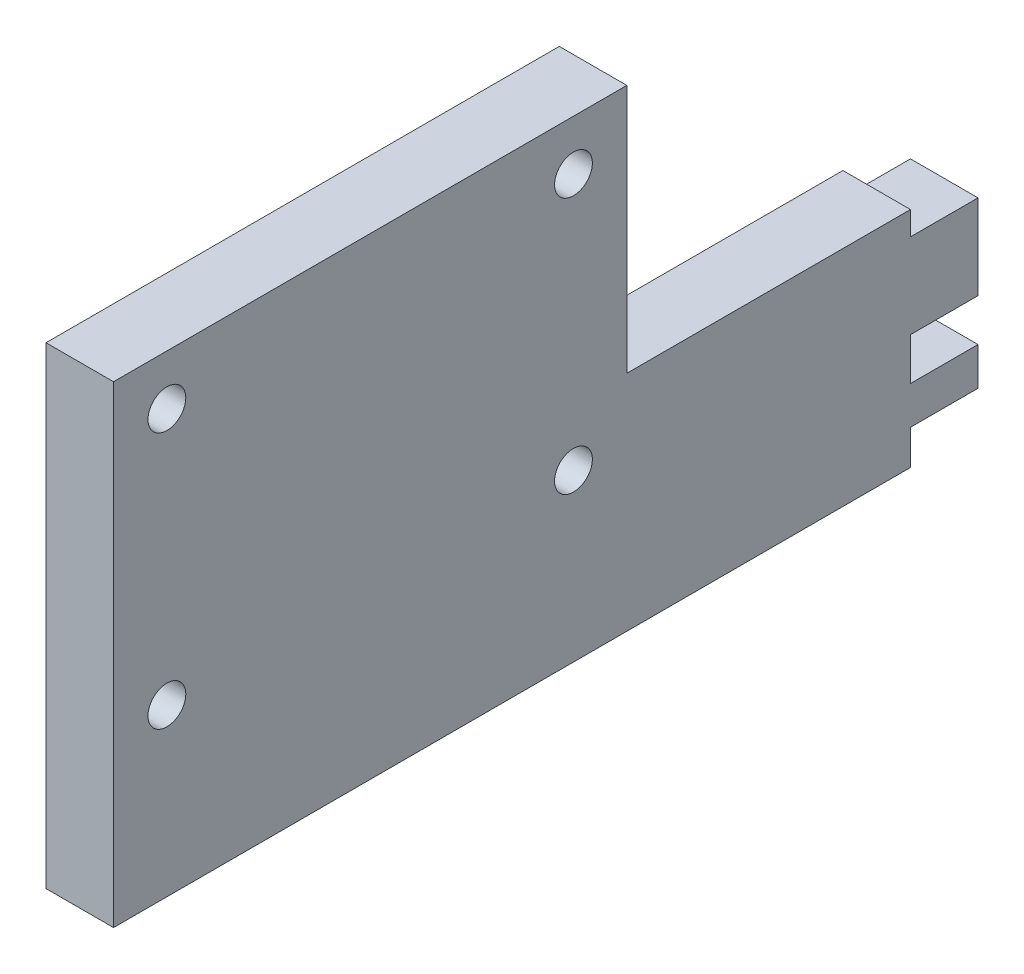
ISO-10303-21;
HEADER;
FILE_DESCRIPTION(('STEP AP214'),'2;1');
FILE_NAME('part.step','',(''),(''),'','','');
FILE_SCHEMA(('AUTOMOTIVE_DESIGN { 1 0 10303 214 1 1 1 1 }'));
ENDSEC;
DATA;
#1=APPLICATION_CONTEXT('core data for automotive mechanical design processes');
#2=APPLICATION_PROTOCOL_DEFINITION('international standard','automotive_design',2000,#1);
#3=PRODUCT_CONTEXT('',#1,'mechanical');
#4=PRODUCT('Part','Part','',(#3));
#5=PRODUCT_RELATED_PRODUCT_CATEGORY('part','',(#4));
#6=PRODUCT_DEFINITION_FORMATION('','',#4);
#7=PRODUCT_DEFINITION_CONTEXT('part definition',#1,'design');
#8=PRODUCT_DEFINITION('design','',#6,#7);
#9=PRODUCT_DEFINITION_SHAPE('','',#8);
#10=(LENGTH_UNIT() NAMED_UNIT(*) SI_UNIT(.MILLI.,.METRE.));
#11=(NAMED_UNIT(*) PLANE_ANGLE_UNIT() SI_UNIT($,.RADIAN.));
#12=(NAMED_UNIT(*) SI_UNIT($,.STERADIAN.) SOLID_ANGLE_UNIT());
#13=UNCERTAINTY_MEASURE_WITH_UNIT(LENGTH_MEASURE(1.E-05),#10,'distance_accuracy_value','');
#14=(GEOMETRIC_REPRESENTATION_CONTEXT(3) GLOBAL_UNCERTAINTY_ASSIGNED_CONTEXT((#13)) GLOBAL_UNIT_ASSIGNED_CONTEXT((#10,
#11,#12)) REPRESENTATION_CONTEXT('',''));
#15=CARTESIAN_POINT('',(0.,0.,0.));
#16=DIRECTION('',(0.,0.,1.));
#17=DIRECTION('',(1.,0.,0.));
#18=AXIS2_PLACEMENT_3D('',#15,#16,#17);
#19=CARTESIAN_POINT('',(5.,0.,0.));
#20=DIRECTION('',(0.,-1.,0.));
#21=DIRECTION('',(0.,0.,-1.));
#22=AXIS2_PLACEMENT_3D('',#19,#20,#21);
#23=PLANE('',#22);
#24=DIRECTION('',(0.,0.,1.));
#25=VECTOR('',#24,1.);
#26=CARTESIAN_POINT('',(0.,0.,0.));
#27=LINE('',#26,#25);
#28=CARTESIAN_POINT('',(0.,0.,0.));
#29=VERTEX_POINT('',#28);
#30=CARTESIAN_POINT('',(0.,0.,21.));
#31=VERTEX_POINT('',#30);
#32=EDGE_CURVE('E183',#29,#31,#27,.T.);
#33=ORIENTED_EDGE('',*,*,#32,.T.);
#34=DIRECTION('',(-1.,0.,0.));
#35=VECTOR('',#34,1.);
#36=CARTESIAN_POINT('',(5.,0.,21.));
#37=LINE('',#36,#35);
#38=CARTESIAN_POINT('',(5.,0.,21.));
#39=VERTEX_POINT('',#38);
#40=EDGE_CURVE('E11',#39,#31,#37,.T.);
#41=ORIENTED_EDGE('',*,*,#40,.F.);
#42=DIRECTION('',(0.,0.,1.));
#43=VECTOR('',#42,1.);
#44=CARTESIAN_POINT('',(5.,0.,0.));
#45=LINE('',#44,#43);
#46=CARTESIAN_POINT('',(5.,0.,0.));
#47=VERTEX_POINT('',#46);
#48=EDGE_CURVE('E262',#47,#39,#45,.T.);
#49=ORIENTED_EDGE('',*,*,#48,.F.);
#50=DIRECTION('',(-1.,0.,0.));
#51=VECTOR('',#50,1.);
#52=CARTESIAN_POINT('',(5.,0.,0.));
#53=LINE('',#52,#51);
#54=EDGE_CURVE('E54',#47,#29,#53,.T.);
#55=ORIENTED_EDGE('',*,*,#54,.T.);
#56=EDGE_LOOP('',(#33,#41,#49,#55));
#57=FACE_BOUND('',#56,.T.);
#58=ADVANCED_FACE('F37',(#57),#23,.F.);
#59=CARTESIAN_POINT('',(5.,0.,21.));
#60=DIRECTION('',(0.,0.,1.));
#61=DIRECTION('',(0.,-1.,0.));
#62=AXIS2_PLACEMENT_3D('',#59,#60,#61);
#63=PLANE('',#62);
#64=DIRECTION('',(0.,1.,0.));
#65=VECTOR('',#64,1.);
#66=CARTESIAN_POINT('',(0.,0.,21.));
#67=LINE('',#66,#65);
#68=CARTESIAN_POINT('',(0.,18.4591204896697,21.));
#69=VERTEX_POINT('',#68);
#70=EDGE_CURVE('E185',#31,#69,#67,.T.);
#71=ORIENTED_EDGE('',*,*,#70,.T.);
#72=DIRECTION('',(-1.,0.,0.));
#73=VECTOR('',#72,1.);
#74=CARTESIAN_POINT('',(5.,18.4591204896697,21.));
#75=LINE('',#74,#73);
#76=CARTESIAN_POINT('',(5.,18.4591204896697,21.));
#77=VERTEX_POINT('',#76);
#78=EDGE_CURVE('E46',#77,#69,#75,.T.);
#79=ORIENTED_EDGE('',*,*,#78,.F.);
#80=DIRECTION('',(0.,1.,0.));
#81=VECTOR('',#80,1.);
#82=CARTESIAN_POINT('',(5.,0.,21.));
#83=LINE('',#82,#81);
#84=EDGE_CURVE('E110',#39,#77,#83,.T.);
#85=ORIENTED_EDGE('',*,*,#84,.F.);
#86=ORIENTED_EDGE('',*,*,#40,.T.);
#87=EDGE_LOOP('',(#71,#79,#85,#86));
#88=FACE_BOUND('',#87,.T.);
#89=ADVANCED_FACE('F246',(#88),#63,.F.);
#90=CARTESIAN_POINT('',(5.,18.4591204896697,0.));
#91=DIRECTION('',(0.,1.,0.));
#92=DIRECTION('',(0.,0.,1.));
#93=AXIS2_PLACEMENT_3D('',#90,#91,#92);
#94=PLANE('',#93);
#95=DIRECTION('',(0.,0.,-1.));
#96=VECTOR('',#95,1.);
#97=CARTESIAN_POINT('',(0.,18.4591204896697,0.));
#98=LINE('',#97,#96);
#99=CARTESIAN_POINT('',(0.,18.4591204896697,59.));
#100=VERTEX_POINT('',#99);
#101=EDGE_CURVE('E188',#100,#69,#98,.T.);
#102=ORIENTED_EDGE('',*,*,#101,.F.);
#103=DIRECTION('',(-1.,0.,0.));
#104=VECTOR('',#103,1.);
#105=CARTESIAN_POINT('',(5.,18.4591204896697,59.));
#106=LINE('',#105,#104);
#107=CARTESIAN_POINT('',(5.,18.4591204896697,59.));
#108=VERTEX_POINT('',#107);
#109=EDGE_CURVE('E239',#108,#100,#106,.T.);
#110=ORIENTED_EDGE('',*,*,#109,.F.);
#111=DIRECTION('',(0.,0.,-1.));
#112=VECTOR('',#111,1.);
#113=CARTESIAN_POINT('',(5.,18.4591204896697,0.));
#114=LINE('',#113,#112);
#115=EDGE_CURVE('E245',#108,#77,#114,.T.);
#116=ORIENTED_EDGE('',*,*,#115,.T.);
#117=ORIENTED_EDGE('',*,*,#78,.T.);
#118=EDGE_LOOP('',(#102,#110,#116,#117));
#119=FACE_BOUND('',#118,.T.);
#120=ADVANCED_FACE('F243',(#119),#94,.T.);
#121=CARTESIAN_POINT('',(5.,0.,59.));
#122=DIRECTION('',(0.,0.,1.));
#123=DIRECTION('',(1.,0.,0.));
#124=AXIS2_PLACEMENT_3D('',#121,#122,#123);
#125=PLANE('',#124);
#126=DIRECTION('',(0.,1.,0.));
#127=VECTOR('',#126,1.);
#128=CARTESIAN_POINT('',(0.,0.,59.));
#129=LINE('',#128,#127);
#130=CARTESIAN_POINT('',(0.,-16.5408795103303,59.));
#131=VERTEX_POINT('',#130);
#132=EDGE_CURVE('E191',#131,#100,#129,.T.);
#133=ORIENTED_EDGE('',*,*,#132,.F.);
#134=DIRECTION('',(-1.,0.,0.));
#135=VECTOR('',#134,1.);
#136=CARTESIAN_POINT('',(5.,-16.5408795103303,59.));
#137=LINE('',#136,#135);
#138=CARTESIAN_POINT('',(5.,-16.5408795103303,59.));
#139=VERTEX_POINT('',#138);
#140=EDGE_CURVE('E237',#139,#131,#137,.T.);
#141=ORIENTED_EDGE('',*,*,#140,.F.);
#142=DIRECTION('',(0.,1.,0.));
#143=VECTOR('',#142,1.);
#144=CARTESIAN_POINT('',(5.,0.,59.));
#145=LINE('',#144,#143);
#146=EDGE_CURVE('E256',#139,#108,#145,.T.);
#147=ORIENTED_EDGE('',*,*,#146,.T.);
#148=ORIENTED_EDGE('',*,*,#109,.T.);
#149=EDGE_LOOP('',(#133,#141,#147,#148));
#150=FACE_BOUND('',#149,.T.);
#151=ADVANCED_FACE('F253',(#150),#125,.T.);
#152=CARTESIAN_POINT('',(5.,-16.5408795103303,0.));
#153=DIRECTION('',(0.,-1.,0.));
#154=DIRECTION('',(0.,0.,-1.));
#155=AXIS2_PLACEMENT_3D('',#152,#153,#154);
#156=PLANE('',#155);
#157=DIRECTION('',(0.,0.,1.));
#158=VECTOR('',#157,1.);
#159=CARTESIAN_POINT('',(0.,-16.5408795103303,0.));
#160=LINE('',#159,#158);
#161=CARTESIAN_POINT('',(0.,-16.5408795103303,0.));
#162=VERTEX_POINT('',#161);
#163=EDGE_CURVE('E194',#162,#131,#160,.T.);
#164=ORIENTED_EDGE('',*,*,#163,.F.);
#165=DIRECTION('',(-1.,0.,0.));
#166=VECTOR('',#165,1.);
#167=CARTESIAN_POINT('',(5.,-16.5408795103303,0.));
#168=LINE('',#167,#166);
#169=CARTESIAN_POINT('',(5.,-16.5408795103303,0.));
#170=VERTEX_POINT('',#169);
#171=EDGE_CURVE('E235',#170,#162,#168,.T.);
#172=ORIENTED_EDGE('',*,*,#171,.F.);
#173=DIRECTION('',(0.,0.,1.));
#174=VECTOR('',#173,1.);
#175=CARTESIAN_POINT('',(5.,-16.5408795103303,0.));
#176=LINE('',#175,#174);
#177=EDGE_CURVE('E260',#170,#139,#176,.T.);
#178=ORIENTED_EDGE('',*,*,#177,.T.);
#179=ORIENTED_EDGE('',*,*,#140,.T.);
#180=EDGE_LOOP('',(#164,#172,#178,#179));
#181=FACE_BOUND('',#180,.T.);
#182=ADVANCED_FACE('F438',(#181),#156,.T.);
#183=CARTESIAN_POINT('',(5.,0.,0.));
#184=DIRECTION('',(0.,0.,-1.));
#185=DIRECTION('',(0.,1.,0.));
#186=AXIS2_PLACEMENT_3D('',#183,#184,#185);
#187=PLANE('',#186);
#188=DIRECTION('',(0.,-1.,0.));
#189=VECTOR('',#188,1.);
#190=CARTESIAN_POINT('',(0.,0.,0.));
#191=LINE('',#190,#189);
#192=CARTESIAN_POINT('',(0.,-13.9635184078165,0.));
#193=VERTEX_POINT('',#192);
#194=EDGE_CURVE('E197',#193,#162,#191,.T.);
#195=ORIENTED_EDGE('',*,*,#194,.F.);
#196=DIRECTION('',(-1.,0.,0.));
#197=VECTOR('',#196,1.);
#198=CARTESIAN_POINT('',(5.,-13.9635184078165,0.));
#199=LINE('',#198,#197);
#200=CARTESIAN_POINT('',(5.,-13.9635184078165,0.));
#201=VERTEX_POINT('',#200);
#202=EDGE_CURVE('E233',#201,#193,#199,.T.);
#203=ORIENTED_EDGE('',*,*,#202,.F.);
#204=DIRECTION('',(0.,-1.,0.));
#205=VECTOR('',#204,1.);
#206=CARTESIAN_POINT('',(5.,0.,0.));
#207=LINE('',#206,#205);
#208=EDGE_CURVE('E267',#201,#170,#207,.T.);
#209=ORIENTED_EDGE('',*,*,#208,.T.);
#210=ORIENTED_EDGE('',*,*,#171,.T.);
#211=EDGE_LOOP('',(#195,#203,#209,#210));
#212=FACE_BOUND('',#211,.T.);
#213=ADVANCED_FACE('F429',(#212),#187,.T.);
#214=CARTESIAN_POINT('',(5.,-13.9635184078165,0.));
#215=DIRECTION('',(0.,1.,0.));
#216=DIRECTION('',(0.,0.,1.));
#217=AXIS2_PLACEMENT_3D('',#214,#215,#216);
#218=PLANE('',#217);
#219=DIRECTION('',(0.,0.,-1.));
#220=VECTOR('',#219,1.);
#221=CARTESIAN_POINT('',(0.,-13.9635184078165,0.));
#222=LINE('',#221,#220);
#223=CARTESIAN_POINT('',(0.,-13.9635184078165,-5.));
#224=VERTEX_POINT('',#223);
#225=EDGE_CURVE('E200',#193,#224,#222,.T.);
#226=ORIENTED_EDGE('',*,*,#225,.T.);
#227=DIRECTION('',(-1.,0.,0.));
#228=VECTOR('',#227,1.);
#229=CARTESIAN_POINT('',(5.,-13.9635184078165,-5.));
#230=LINE('',#229,#228);
#231=CARTESIAN_POINT('',(5.,-13.9635184078165,-5.));
#232=VERTEX_POINT('',#231);
#233=EDGE_CURVE('E231',#232,#224,#230,.T.);
#234=ORIENTED_EDGE('',*,*,#233,.F.);
#235=DIRECTION('',(0.,0.,-1.));
#236=VECTOR('',#235,1.);
#237=CARTESIAN_POINT('',(5.,-13.9635184078165,0.));
#238=LINE('',#237,#236);
#239=EDGE_CURVE('E270',#201,#232,#238,.T.);
#240=ORIENTED_EDGE('',*,*,#239,.F.);
#241=ORIENTED_EDGE('',*,*,#202,.T.);
#242=EDGE_LOOP('',(#226,#234,#240,#241));
#243=FACE_BOUND('',#242,.T.);
#244=ADVANCED_FACE('F420',(#243),#218,.F.);
#245=CARTESIAN_POINT('',(5.,0.,-5.00000000000001));
#246=DIRECTION('',(0.,0.,-1.));
#247=DIRECTION('',(0.,1.,0.));
#248=AXIS2_PLACEMENT_3D('',#245,#246,#247);
#249=PLANE('',#248);
#250=DIRECTION('',(0.,-1.,0.));
#251=VECTOR('',#250,1.);
#252=CARTESIAN_POINT('',(0.,0.,-5.00000000000001));
#253=LINE('',#252,#251);
#254=CARTESIAN_POINT('',(0.,-11.156486180237,-5.));
#255=VERTEX_POINT('',#254);
#256=EDGE_CURVE('E203',#255,#224,#253,.T.);
#257=ORIENTED_EDGE('',*,*,#256,.F.);
#258=DIRECTION('',(-1.,0.,0.));
#259=VECTOR('',#258,1.);
#260=CARTESIAN_POINT('',(5.,-11.156486180237,-5.));
#261=LINE('',#260,#259);
#262=CARTESIAN_POINT('',(5.,-11.156486180237,-5.));
#263=VERTEX_POINT('',#262);
#264=EDGE_CURVE('E229',#263,#255,#261,.T.);
#265=ORIENTED_EDGE('',*,*,#264,.F.);
#266=DIRECTION('',(0.,-1.,0.));
#267=VECTOR('',#266,1.);
#268=CARTESIAN_POINT('',(5.,0.,-5.00000000000001));
#269=LINE('',#268,#267);
#270=EDGE_CURVE('E272',#263,#232,#269,.T.);
#271=ORIENTED_EDGE('',*,*,#270,.T.);
#272=ORIENTED_EDGE('',*,*,#233,.T.);
#273=EDGE_LOOP('',(#257,#265,#271,#272));
#274=FACE_BOUND('',#273,.T.);
#275=ADVANCED_FACE('F412',(#274),#249,.T.);
#276=CARTESIAN_POINT('',(5.,-11.156486180237,0.));
#277=DIRECTION('',(0.,1.,0.));
#278=DIRECTION('',(0.,0.,1.));
#279=AXIS2_PLACEMENT_3D('',#276,#277,#278);
#280=PLANE('',#279);
#281=DIRECTION('',(0.,0.,-1.));
#282=VECTOR('',#281,1.);
#283=CARTESIAN_POINT('',(0.,-11.156486180237,0.));
#284=LINE('',#283,#282);
#285=CARTESIAN_POINT('',(0.,-11.156486180237,0.));
#286=VERTEX_POINT('',#285);
#287=EDGE_CURVE('E206',#286,#255,#284,.T.);
#288=ORIENTED_EDGE('',*,*,#287,.F.);
#289=DIRECTION('',(-1.,0.,0.));
#290=VECTOR('',#289,1.);
#291=CARTESIAN_POINT('',(5.,-11.156486180237,0.));
#292=LINE('',#291,#290);
#293=CARTESIAN_POINT('',(5.,-11.156486180237,0.));
#294=VERTEX_POINT('',#293);
#295=EDGE_CURVE('E227',#294,#286,#292,.T.);
#296=ORIENTED_EDGE('',*,*,#295,.F.);
#297=DIRECTION('',(0.,0.,-1.));
#298=VECTOR('',#297,1.);
#299=CARTESIAN_POINT('',(5.,-11.156486180237,0.));
#300=LINE('',#299,#298);
#301=EDGE_CURVE('E275',#294,#263,#300,.T.);
#302=ORIENTED_EDGE('',*,*,#301,.T.);
#303=ORIENTED_EDGE('',*,*,#264,.T.);
#304=EDGE_LOOP('',(#288,#296,#302,#303));
#305=FACE_BOUND('',#304,.T.);
#306=ADVANCED_FACE('F287',(#305),#280,.T.);
#307=CARTESIAN_POINT('',(5.,0.,0.));
#308=DIRECTION('',(0.,0.,-1.));
#309=DIRECTION('',(0.,1.,0.));
#310=AXIS2_PLACEMENT_3D('',#307,#308,#309);
#311=PLANE('',#310);
#312=DIRECTION('',(0.,-1.,0.));
#313=VECTOR('',#312,1.);
#314=CARTESIAN_POINT('',(0.,0.,0.));
#315=LINE('',#314,#313);
#316=CARTESIAN_POINT('',(0.,-8.02498397090545,0.));
#317=VERTEX_POINT('',#316);
#318=EDGE_CURVE('E209',#317,#286,#315,.T.);
#319=ORIENTED_EDGE('',*,*,#318,.F.);
#320=DIRECTION('',(-1.,0.,0.));
#321=VECTOR('',#320,1.);
#322=CARTESIAN_POINT('',(5.,-8.02498397090545,0.));
#323=LINE('',#322,#321);
#324=CARTESIAN_POINT('',(5.,-8.02498397090545,0.));
#325=VERTEX_POINT('',#324);
#326=EDGE_CURVE('E225',#325,#317,#323,.T.);
#327=ORIENTED_EDGE('',*,*,#326,.F.);
#328=DIRECTION('',(0.,-1.,0.));
#329=VECTOR('',#328,1.);
#330=CARTESIAN_POINT('',(5.,0.,0.));
#331=LINE('',#330,#329);
#332=EDGE_CURVE('E278',#325,#294,#331,.T.);
#333=ORIENTED_EDGE('',*,*,#332,.T.);
#334=ORIENTED_EDGE('',*,*,#295,.T.);
#335=EDGE_LOOP('',(#319,#327,#333,#334));
#336=FACE_BOUND('',#335,.T.);
#337=ADVANCED_FACE('F282',(#336),#311,.T.);
#338=CARTESIAN_POINT('',(5.,-8.02498397090545,0.));
#339=DIRECTION('',(0.,1.,0.));
#340=DIRECTION('',(0.,0.,1.));
#341=AXIS2_PLACEMENT_3D('',#338,#339,#340);
#342=PLANE('',#341);
#343=DIRECTION('',(0.,0.,-1.));
#344=VECTOR('',#343,1.);
#345=CARTESIAN_POINT('',(0.,-8.02498397090545,0.));
#346=LINE('',#345,#344);
#347=CARTESIAN_POINT('',(0.,-8.02498397090545,-5.));
#348=VERTEX_POINT('',#347);
#349=EDGE_CURVE('E212',#317,#348,#346,.T.);
#350=ORIENTED_EDGE('',*,*,#349,.T.);
#351=DIRECTION('',(-1.,0.,0.));
#352=VECTOR('',#351,1.);
#353=CARTESIAN_POINT('',(5.,-8.02498397090545,-5.));
#354=LINE('',#353,#352);
#355=CARTESIAN_POINT('',(5.,-8.02498397090545,-5.));
#356=VERTEX_POINT('',#355);
#357=EDGE_CURVE('E153',#356,#348,#354,.T.);
#358=ORIENTED_EDGE('',*,*,#357,.F.);
#359=DIRECTION('',(0.,0.,-1.));
#360=VECTOR('',#359,1.);
#361=CARTESIAN_POINT('',(5.,-8.02498397090545,0.));
#362=LINE('',#361,#360);
#363=EDGE_CURVE('E162',#325,#356,#362,.T.);
#364=ORIENTED_EDGE('',*,*,#363,.F.);
#365=ORIENTED_EDGE('',*,*,#326,.T.);
#366=EDGE_LOOP('',(#350,#358,#364,#365));
#367=FACE_BOUND('',#366,.T.);
#368=ADVANCED_FACE('F291',(#367),#342,.F.);
#369=CARTESIAN_POINT('',(5.,0.,-5.));
#370=DIRECTION('',(0.,0.,-1.));
#371=DIRECTION('',(-1.,0.,0.));
#372=AXIS2_PLACEMENT_3D('',#369,#370,#371);
#373=PLANE('',#372);
#374=DIRECTION('',(0.,-1.,0.));
#375=VECTOR('',#374,1.);
#376=CARTESIAN_POINT('',(0.,0.,-5.));
#377=LINE('',#376,#375);
#378=CARTESIAN_POINT('',(0.,-1.75207797940402,-5.));
#379=VERTEX_POINT('',#378);
#380=EDGE_CURVE('E149',#379,#348,#377,.T.);
#381=ORIENTED_EDGE('',*,*,#380,.F.);
#382=DIRECTION('',(-1.,0.,0.));
#383=VECTOR('',#382,1.);
#384=CARTESIAN_POINT('',(5.,-1.75207797940402,-5.));
#385=LINE('',#384,#383);
#386=CARTESIAN_POINT('',(5.,-1.75207797940402,-5.));
#387=VERTEX_POINT('',#386);
#388=EDGE_CURVE('E144',#387,#379,#385,.T.);
#389=ORIENTED_EDGE('',*,*,#388,.F.);
#390=DIRECTION('',(0.,-1.,0.));
#391=VECTOR('',#390,1.);
#392=CARTESIAN_POINT('',(5.,0.,-5.));
#393=LINE('',#392,#391);
#394=EDGE_CURVE('E147',#387,#356,#393,.T.);
#395=ORIENTED_EDGE('',*,*,#394,.T.);
#396=ORIENTED_EDGE('',*,*,#357,.T.);
#397=EDGE_LOOP('',(#381,#389,#395,#396));
#398=FACE_BOUND('',#397,.T.);
#399=ADVANCED_FACE('F146',(#398),#373,.T.);
#400=CARTESIAN_POINT('',(5.,-1.75207797940402,0.));
#401=DIRECTION('',(0.,1.,0.));
#402=DIRECTION('',(0.,0.,1.));
#403=AXIS2_PLACEMENT_3D('',#400,#401,#402);
#404=PLANE('',#403);
#405=DIRECTION('',(0.,0.,-1.));
#406=VECTOR('',#405,1.);
#407=CARTESIAN_POINT('',(0.,-1.75207797940402,0.));
#408=LINE('',#407,#406);
#409=CARTESIAN_POINT('',(0.,-1.75207797940402,0.));
#410=VERTEX_POINT('',#409);
#411=EDGE_CURVE('E216',#410,#379,#408,.T.);
#412=ORIENTED_EDGE('',*,*,#411,.F.);
#413=DIRECTION('',(-1.,0.,0.));
#414=VECTOR('',#413,1.);
#415=CARTESIAN_POINT('',(5.,-1.75207797940402,0.));
#416=LINE('',#415,#414);
#417=CARTESIAN_POINT('',(5.,-1.75207797940402,0.));
#418=VERTEX_POINT('',#417);
#419=EDGE_CURVE('E98',#418,#410,#416,.T.);
#420=ORIENTED_EDGE('',*,*,#419,.F.);
#421=DIRECTION('',(0.,0.,-1.));
#422=VECTOR('',#421,1.);
#423=CARTESIAN_POINT('',(5.,-1.75207797940402,0.));
#424=LINE('',#423,#422);
#425=EDGE_CURVE('E159',#418,#387,#424,.T.);
#426=ORIENTED_EDGE('',*,*,#425,.T.);
#427=ORIENTED_EDGE('',*,*,#388,.T.);
#428=EDGE_LOOP('',(#412,#420,#426,#427));
#429=FACE_BOUND('',#428,.T.);
#430=ADVANCED_FACE('F165',(#429),#404,.T.);
#431=CARTESIAN_POINT('',(5.,14.7591204896697,55.05));
#432=DIRECTION('',(-1.,0.,0.));
#433=DIRECTION('',(0.,0.,1.));
#434=AXIS2_PLACEMENT_3D('',#431,#432,#433);
#435=CYLINDRICAL_SURFACE('',#434,1.4);
#436=CARTESIAN_POINT('',(5.,14.7591204896697,55.05));
#437=DIRECTION('',(1.,0.,0.));
#438=DIRECTION('',(0.,0.,-1.));
#439=AXIS2_PLACEMENT_3D('',#436,#437,#438);
#440=CIRCLE('',#439,1.4);
#441=CARTESIAN_POINT('',(5.,14.7591204896697,53.65));
#442=VERTEX_POINT('',#441);
#443=EDGE_CURVE('E488',#442,#442,#440,.T.);
#444=ORIENTED_EDGE('',*,*,#443,.T.);
#445=EDGE_LOOP('',(#444));
#446=FACE_BOUND('',#445,.T.);
#447=CARTESIAN_POINT('',(0.,14.7591204896697,55.05));
#448=DIRECTION('',(1.,0.,0.));
#449=DIRECTION('',(0.,0.,-1.));
#450=AXIS2_PLACEMENT_3D('',#447,#448,#449);
#451=CIRCLE('',#450,1.4);
#452=CARTESIAN_POINT('',(0.,14.7591204896697,53.65));
#453=VERTEX_POINT('',#452);
#454=EDGE_CURVE('E180',#453,#453,#451,.T.);
#455=ORIENTED_EDGE('',*,*,#454,.F.);
#456=EDGE_LOOP('',(#455));
#457=FACE_BOUND('',#456,.T.);
#458=ADVANCED_FACE('F308',(#446,#457),#435,.F.);
#459=CARTESIAN_POINT('',(5.,14.7591204896697,24.95));
#460=DIRECTION('',(-1.,0.,0.));
#461=DIRECTION('',(0.,0.,1.));
#462=AXIS2_PLACEMENT_3D('',#459,#460,#461);
#463=CYLINDRICAL_SURFACE('',#462,1.4);
#464=CARTESIAN_POINT('',(5.,14.7591204896697,24.95));
#465=DIRECTION('',(1.,0.,0.));
#466=DIRECTION('',(0.,0.,-1.));
#467=AXIS2_PLACEMENT_3D('',#464,#465,#466);
#468=CIRCLE('',#467,1.4);
#469=CARTESIAN_POINT('',(5.,14.7591204896697,23.55));
#470=VERTEX_POINT('',#469);
#471=EDGE_CURVE('E490',#470,#470,#468,.T.);
#472=ORIENTED_EDGE('',*,*,#471,.T.);
#473=EDGE_LOOP('',(#472));
#474=FACE_BOUND('',#473,.T.);
#475=CARTESIAN_POINT('',(0.,14.7591204896697,24.95));
#476=DIRECTION('',(1.,0.,0.));
#477=DIRECTION('',(0.,0.,-1.));
#478=AXIS2_PLACEMENT_3D('',#475,#476,#477);
#479=CIRCLE('',#478,1.4);
#480=CARTESIAN_POINT('',(0.,14.7591204896697,23.55));
#481=VERTEX_POINT('',#480);
#482=EDGE_CURVE('E177',#481,#481,#479,.T.);
#483=ORIENTED_EDGE('',*,*,#482,.F.);
#484=EDGE_LOOP('',(#483));
#485=FACE_BOUND('',#484,.T.);
#486=ADVANCED_FACE('F311',(#474,#485),#463,.F.);
#487=CARTESIAN_POINT('',(5.,-4.24087951033035,55.05));
#488=DIRECTION('',(-1.,0.,0.));
#489=DIRECTION('',(0.,0.,1.));
#490=AXIS2_PLACEMENT_3D('',#487,#488,#489);
#491=CYLINDRICAL_SURFACE('',#490,1.4);
#492=CARTESIAN_POINT('',(5.,-4.24087951033035,55.05));
#493=DIRECTION('',(1.,0.,0.));
#494=DIRECTION('',(0.,0.,-1.));
#495=AXIS2_PLACEMENT_3D('',#492,#493,#494);
#496=CIRCLE('',#495,1.4);
#497=CARTESIAN_POINT('',(5.,-4.24087951033035,53.65));
#498=VERTEX_POINT('',#497);
#499=EDGE_CURVE('E326',#498,#498,#496,.T.);
#500=ORIENTED_EDGE('',*,*,#499,.T.);
#501=EDGE_LOOP('',(#500));
#502=FACE_BOUND('',#501,.T.);
#503=CARTESIAN_POINT('',(0.,-4.24087951033035,55.05));
#504=DIRECTION('',(1.,0.,0.));
#505=DIRECTION('',(0.,0.,-1.));
#506=AXIS2_PLACEMENT_3D('',#503,#504,#505);
#507=CIRCLE('',#506,1.4);
#508=CARTESIAN_POINT('',(0.,-4.24087951033035,53.65));
#509=VERTEX_POINT('',#508);
#510=EDGE_CURVE('E174',#509,#509,#507,.T.);
#511=ORIENTED_EDGE('',*,*,#510,.F.);
#512=EDGE_LOOP('',(#511));
#513=FACE_BOUND('',#512,.T.);
#514=ADVANCED_FACE('F314',(#502,#513),#491,.F.);
#515=CARTESIAN_POINT('',(5.,-4.24087951033034,24.95));
#516=DIRECTION('',(-1.,0.,0.));
#517=DIRECTION('',(0.,0.,1.));
#518=AXIS2_PLACEMENT_3D('',#515,#516,#517);
#519=CYLINDRICAL_SURFACE('',#518,1.4);
#520=CARTESIAN_POINT('',(5.,-4.24087951033034,24.95));
#521=DIRECTION('',(1.,0.,0.));
#522=DIRECTION('',(0.,0.,-1.));
#523=AXIS2_PLACEMENT_3D('',#520,#521,#522);
#524=CIRCLE('',#523,1.4);
#525=CARTESIAN_POINT('',(5.,-4.24087951033034,23.55));
#526=VERTEX_POINT('',#525);
#527=EDGE_CURVE('E221',#526,#526,#524,.T.);
#528=ORIENTED_EDGE('',*,*,#527,.T.);
#529=EDGE_LOOP('',(#528));
#530=FACE_BOUND('',#529,.T.);
#531=CARTESIAN_POINT('',(0.,-4.24087951033034,24.95));
#532=DIRECTION('',(1.,0.,0.));
#533=DIRECTION('',(0.,0.,-1.));
#534=AXIS2_PLACEMENT_3D('',#531,#532,#533);
#535=CIRCLE('',#534,1.4);
#536=CARTESIAN_POINT('',(0.,-4.24087951033034,23.55));
#537=VERTEX_POINT('',#536);
#538=EDGE_CURVE('E171',#537,#537,#535,.T.);
#539=ORIENTED_EDGE('',*,*,#538,.F.);
#540=EDGE_LOOP('',(#539));
#541=FACE_BOUND('',#540,.T.);
#542=ADVANCED_FACE('F39',(#530,#541),#519,.F.);
#543=CARTESIAN_POINT('',(5.,0.,0.));
#544=DIRECTION('',(0.,0.,-1.));
#545=DIRECTION('',(-1.,0.,0.));
#546=AXIS2_PLACEMENT_3D('',#543,#544,#545);
#547=PLANE('',#546);
#548=DIRECTION('',(0.,-1.,0.));
#549=VECTOR('',#548,1.);
#550=CARTESIAN_POINT('',(0.,0.,0.));
#551=LINE('',#550,#549);
#552=EDGE_CURVE('E218',#29,#410,#551,.T.);
#553=ORIENTED_EDGE('',*,*,#552,.F.);
#554=ORIENTED_EDGE('',*,*,#54,.F.);
#555=DIRECTION('',(0.,-1.,0.));
#556=VECTOR('',#555,1.);
#557=CARTESIAN_POINT('',(5.,0.,0.));
#558=LINE('',#557,#556);
#559=EDGE_CURVE('E166',#47,#418,#558,.T.);
#560=ORIENTED_EDGE('',*,*,#559,.T.);
#561=ORIENTED_EDGE('',*,*,#419,.T.);
#562=EDGE_LOOP('',(#553,#554,#560,#561));
#563=FACE_BOUND('',#562,.T.);
#564=ADVANCED_FACE('F321',(#563),#547,.T.);
#565=CARTESIAN_POINT('',(5.,0.,0.));
#566=DIRECTION('',(1.,0.,0.));
#567=DIRECTION('',(0.,0.,-1.));
#568=AXIS2_PLACEMENT_3D('',#565,#566,#567);
#569=PLANE('',#568);
#570=ORIENTED_EDGE('',*,*,#527,.F.);
#571=EDGE_LOOP('',(#570));
#572=FACE_BOUND('',#571,.T.);
#573=ORIENTED_EDGE('',*,*,#499,.F.);
#574=EDGE_LOOP('',(#573));
#575=FACE_BOUND('',#574,.T.);
#576=ORIENTED_EDGE('',*,*,#471,.F.);
#577=EDGE_LOOP('',(#576));
#578=FACE_BOUND('',#577,.T.);
#579=ORIENTED_EDGE('',*,*,#443,.F.);
#580=EDGE_LOOP('',(#579));
#581=FACE_BOUND('',#580,.T.);
#582=ORIENTED_EDGE('',*,*,#48,.T.);
#583=ORIENTED_EDGE('',*,*,#84,.T.);
#584=ORIENTED_EDGE('',*,*,#115,.F.);
#585=ORIENTED_EDGE('',*,*,#146,.F.);
#586=ORIENTED_EDGE('',*,*,#177,.F.);
#587=ORIENTED_EDGE('',*,*,#208,.F.);
#588=ORIENTED_EDGE('',*,*,#239,.T.);
#589=ORIENTED_EDGE('',*,*,#270,.F.);
#590=ORIENTED_EDGE('',*,*,#301,.F.);
#591=ORIENTED_EDGE('',*,*,#332,.F.);
#592=ORIENTED_EDGE('',*,*,#363,.T.);
#593=ORIENTED_EDGE('',*,*,#394,.F.);
#594=ORIENTED_EDGE('',*,*,#425,.F.);
#595=ORIENTED_EDGE('',*,*,#559,.F.);
#596=EDGE_LOOP('',(#582,#583,#584,#585,#586,#587,#588,#589,#590,#591,#592,#593,#594,#595));
#597=FACE_BOUND('',#596,.T.);
#598=ADVANCED_FACE('F157',(#572,#575,#578,#581,#597),#569,.T.);
#599=CARTESIAN_POINT('',(0.,0.,0.));
#600=DIRECTION('',(1.,0.,0.));
#601=DIRECTION('',(0.,0.,-1.));
#602=AXIS2_PLACEMENT_3D('',#599,#600,#601);
#603=PLANE('',#602);
#604=ORIENTED_EDGE('',*,*,#538,.T.);
#605=EDGE_LOOP('',(#604));
#606=FACE_BOUND('',#605,.T.);
#607=ORIENTED_EDGE('',*,*,#510,.T.);
#608=EDGE_LOOP('',(#607));
#609=FACE_BOUND('',#608,.T.);
#610=ORIENTED_EDGE('',*,*,#482,.T.);
#611=EDGE_LOOP('',(#610));
#612=FACE_BOUND('',#611,.T.);
#613=ORIENTED_EDGE('',*,*,#454,.T.);
#614=EDGE_LOOP('',(#613));
#615=FACE_BOUND('',#614,.T.);
#616=ORIENTED_EDGE('',*,*,#32,.F.);
#617=ORIENTED_EDGE('',*,*,#552,.T.);
#618=ORIENTED_EDGE('',*,*,#411,.T.);
#619=ORIENTED_EDGE('',*,*,#380,.T.);
#620=ORIENTED_EDGE('',*,*,#349,.F.);
#621=ORIENTED_EDGE('',*,*,#318,.T.);
#622=ORIENTED_EDGE('',*,*,#287,.T.);
#623=ORIENTED_EDGE('',*,*,#256,.T.);
#624=ORIENTED_EDGE('',*,*,#225,.F.);
#625=ORIENTED_EDGE('',*,*,#194,.T.);
#626=ORIENTED_EDGE('',*,*,#163,.T.);
#627=ORIENTED_EDGE('',*,*,#132,.T.);
#628=ORIENTED_EDGE('',*,*,#101,.T.);
#629=ORIENTED_EDGE('',*,*,#70,.F.);
#630=EDGE_LOOP('',(#616,#617,#618,#619,#620,#621,#622,#623,#624,#625,#626,#627,#628,#629));
#631=FACE_BOUND('',#630,.T.);
#632=ADVANCED_FACE('F249',(#606,#609,#612,#615,#631),#603,.F.);
#633=CLOSED_SHELL('',(#58,#89,#120,#151,#182,#213,#244,#275,#306,#337,#368,#399,#430,#458,#486,
#514,#542,#564,#598,#632));
#634=MANIFOLD_SOLID_BREP('B2',#633);
#635=ADVANCED_BREP_SHAPE_REPRESENTATION('',(#18,#634),#14);
#636=SHAPE_DEFINITION_REPRESENTATION(#9,#635);
ENDSEC;
END-ISO-10303-21;
